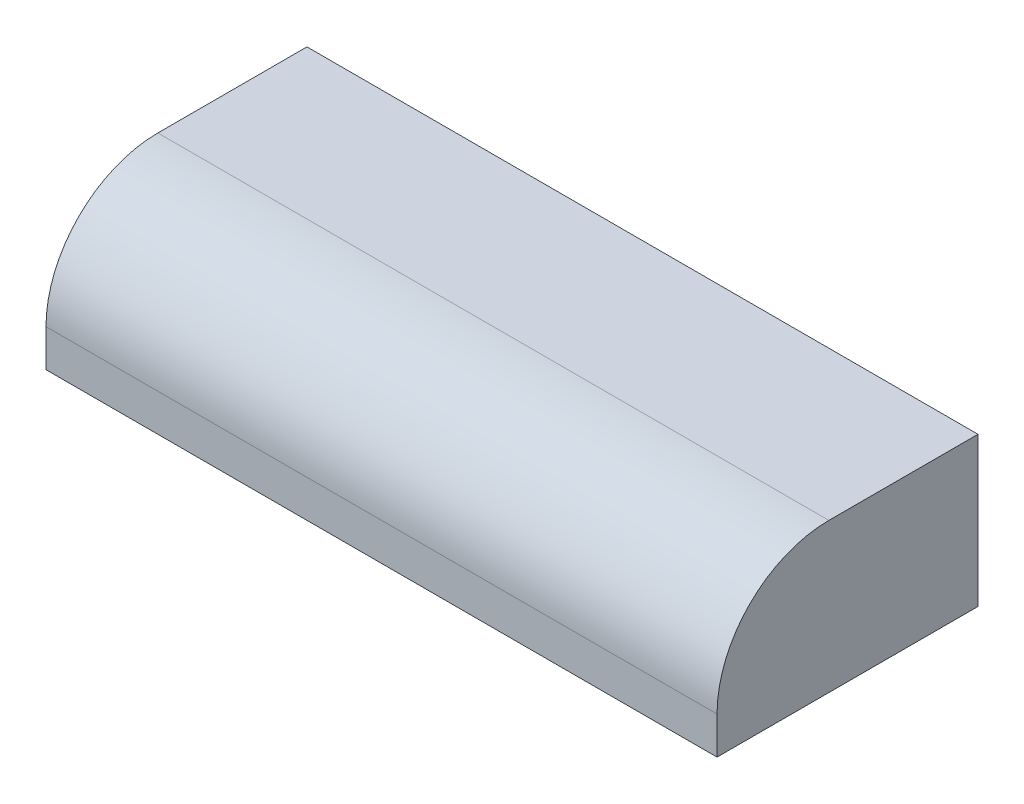
ISO-10303-21;
HEADER;
FILE_DESCRIPTION(('STEP AP214'),'2;1');
FILE_NAME('part.step','',(''),(''),'','','');
FILE_SCHEMA(('AUTOMOTIVE_DESIGN { 1 0 10303 214 1 1 1 1 }'));
ENDSEC;
DATA;
#1=APPLICATION_CONTEXT('core data for automotive mechanical design processes');
#2=APPLICATION_PROTOCOL_DEFINITION('international standard','automotive_design',2000,#1);
#3=PRODUCT_CONTEXT('',#1,'mechanical');
#4=PRODUCT('Part','Part','',(#3));
#5=PRODUCT_RELATED_PRODUCT_CATEGORY('part','',(#4));
#6=PRODUCT_DEFINITION_FORMATION('','',#4);
#7=PRODUCT_DEFINITION_CONTEXT('part definition',#1,'design');
#8=PRODUCT_DEFINITION('design','',#6,#7);
#9=PRODUCT_DEFINITION_SHAPE('','',#8);
#10=(LENGTH_UNIT() NAMED_UNIT(*) SI_UNIT(.MILLI.,.METRE.));
#11=(NAMED_UNIT(*) PLANE_ANGLE_UNIT() SI_UNIT($,.RADIAN.));
#12=(NAMED_UNIT(*) SI_UNIT($,.STERADIAN.) SOLID_ANGLE_UNIT());
#13=UNCERTAINTY_MEASURE_WITH_UNIT(LENGTH_MEASURE(1.E-05),#10,'distance_accuracy_value','');
#14=(GEOMETRIC_REPRESENTATION_CONTEXT(3) GLOBAL_UNCERTAINTY_ASSIGNED_CONTEXT((#13)) GLOBAL_UNIT_ASSIGNED_CONTEXT((#10,
#11,#12)) REPRESENTATION_CONTEXT('',''));
#15=CARTESIAN_POINT('',(0.,0.,0.));
#16=DIRECTION('',(0.,0.,1.));
#17=DIRECTION('',(1.,0.,0.));
#18=AXIS2_PLACEMENT_3D('',#15,#16,#17);
#19=CARTESIAN_POINT('',(914.4,0.,0.));
#20=DIRECTION('',(0.,0.,-1.));
#21=DIRECTION('',(-1.,0.,0.));
#22=AXIS2_PLACEMENT_3D('',#19,#20,#21);
#23=PLANE('',#22);
#24=DIRECTION('',(0.,-1.,0.));
#25=VECTOR('',#24,1.);
#26=CARTESIAN_POINT('',(914.4,0.,0.));
#27=LINE('',#26,#25);
#28=CARTESIAN_POINT('',(914.4,50.8,0.));
#29=VERTEX_POINT('',#28);
#30=CARTESIAN_POINT('',(914.4,0.,0.));
#31=VERTEX_POINT('',#30);
#32=EDGE_CURVE('E79',#29,#31,#27,.T.);
#33=ORIENTED_EDGE('',*,*,#32,.F.);
#34=DIRECTION('',(-1.,0.,0.));
#35=VECTOR('',#34,1.);
#36=CARTESIAN_POINT('',(914.4,50.8,0.));
#37=LINE('',#36,#35);
#38=CARTESIAN_POINT('',(0.,50.8,0.));
#39=VERTEX_POINT('',#38);
#40=EDGE_CURVE('E102',#29,#39,#37,.T.);
#41=ORIENTED_EDGE('',*,*,#40,.T.);
#42=DIRECTION('',(0.,-1.,0.));
#43=VECTOR('',#42,1.);
#44=CARTESIAN_POINT('',(0.,0.,0.));
#45=LINE('',#44,#43);
#46=CARTESIAN_POINT('',(0.,0.,0.));
#47=VERTEX_POINT('',#46);
#48=EDGE_CURVE('E100',#39,#47,#45,.T.);
#49=ORIENTED_EDGE('',*,*,#48,.T.);
#50=DIRECTION('',(-1.,0.,0.));
#51=VECTOR('',#50,1.);
#52=CARTESIAN_POINT('',(914.4,0.,0.));
#53=LINE('',#52,#51);
#54=EDGE_CURVE('E94',#31,#47,#53,.T.);
#55=ORIENTED_EDGE('',*,*,#54,.F.);
#56=EDGE_LOOP('',(#33,#41,#49,#55));
#57=FACE_BOUND('',#56,.T.);
#58=ADVANCED_FACE('F33',(#57),#23,.F.);
#59=CARTESIAN_POINT('',(914.4,0.,-355.6));
#60=DIRECTION('',(0.,1.,0.));
#61=DIRECTION('',(0.,0.,1.));
#62=AXIS2_PLACEMENT_3D('',#59,#60,#61);
#63=PLANE('',#62);
#64=DIRECTION('',(0.,0.,-1.));
#65=VECTOR('',#64,1.);
#66=CARTESIAN_POINT('',(0.,0.,-355.6));
#67=LINE('',#66,#65);
#68=CARTESIAN_POINT('',(0.,0.,-355.6));
#69=VERTEX_POINT('',#68);
#70=EDGE_CURVE('E115',#47,#69,#67,.T.);
#71=ORIENTED_EDGE('',*,*,#70,.T.);
#72=DIRECTION('',(-1.,0.,0.));
#73=VECTOR('',#72,1.);
#74=CARTESIAN_POINT('',(914.4,0.,-355.6));
#75=LINE('',#74,#73);
#76=CARTESIAN_POINT('',(914.4,0.,-355.6));
#77=VERTEX_POINT('',#76);
#78=EDGE_CURVE('E96',#77,#69,#75,.T.);
#79=ORIENTED_EDGE('',*,*,#78,.F.);
#80=DIRECTION('',(0.,0.,-1.));
#81=VECTOR('',#80,1.);
#82=CARTESIAN_POINT('',(914.4,0.,-355.6));
#83=LINE('',#82,#81);
#84=EDGE_CURVE('E82',#31,#77,#83,.T.);
#85=ORIENTED_EDGE('',*,*,#84,.F.);
#86=ORIENTED_EDGE('',*,*,#54,.T.);
#87=EDGE_LOOP('',(#71,#79,#85,#86));
#88=FACE_BOUND('',#87,.T.);
#89=ADVANCED_FACE('F93',(#88),#63,.F.);
#90=CARTESIAN_POINT('',(914.4,203.2,-355.6));
#91=DIRECTION('',(0.,0.,1.));
#92=DIRECTION('',(1.,0.,0.));
#93=AXIS2_PLACEMENT_3D('',#90,#91,#92);
#94=PLANE('',#93);
#95=DIRECTION('',(0.,1.,0.));
#96=VECTOR('',#95,1.);
#97=CARTESIAN_POINT('',(0.,203.2,-355.6));
#98=LINE('',#97,#96);
#99=CARTESIAN_POINT('',(0.,203.2,-355.6));
#100=VERTEX_POINT('',#99);
#101=EDGE_CURVE('E113',#69,#100,#98,.T.);
#102=ORIENTED_EDGE('',*,*,#101,.T.);
#103=DIRECTION('',(-1.,0.,0.));
#104=VECTOR('',#103,1.);
#105=CARTESIAN_POINT('',(914.4,203.2,-355.6));
#106=LINE('',#105,#104);
#107=CARTESIAN_POINT('',(914.4,203.2,-355.6));
#108=VERTEX_POINT('',#107);
#109=EDGE_CURVE('E105',#108,#100,#106,.T.);
#110=ORIENTED_EDGE('',*,*,#109,.F.);
#111=DIRECTION('',(0.,1.,0.));
#112=VECTOR('',#111,1.);
#113=CARTESIAN_POINT('',(914.4,203.2,-355.6));
#114=LINE('',#113,#112);
#115=EDGE_CURVE('E98',#77,#108,#114,.T.);
#116=ORIENTED_EDGE('',*,*,#115,.F.);
#117=ORIENTED_EDGE('',*,*,#78,.T.);
#118=EDGE_LOOP('',(#102,#110,#116,#117));
#119=FACE_BOUND('',#118,.T.);
#120=ADVANCED_FACE('F121',(#119),#94,.F.);
#121=CARTESIAN_POINT('',(914.4,203.2,0.));
#122=DIRECTION('',(0.,-1.,0.));
#123=DIRECTION('',(0.,0.,-1.));
#124=AXIS2_PLACEMENT_3D('',#121,#122,#123);
#125=PLANE('',#124);
#126=DIRECTION('',(0.,0.,1.));
#127=VECTOR('',#126,1.);
#128=CARTESIAN_POINT('',(0.,203.2,0.));
#129=LINE('',#128,#127);
#130=CARTESIAN_POINT('',(0.,203.2,-152.4));
#131=VERTEX_POINT('',#130);
#132=EDGE_CURVE('E89',#100,#131,#129,.T.);
#133=ORIENTED_EDGE('',*,*,#132,.T.);
#134=DIRECTION('',(-1.,0.,0.));
#135=VECTOR('',#134,1.);
#136=CARTESIAN_POINT('',(914.4,203.2,-152.4));
#137=LINE('',#136,#135);
#138=CARTESIAN_POINT('',(914.4,203.2,-152.4));
#139=VERTEX_POINT('',#138);
#140=EDGE_CURVE('E41',#131,#139,#137,.F.);
#141=ORIENTED_EDGE('',*,*,#140,.T.);
#142=DIRECTION('',(0.,0.,1.));
#143=VECTOR('',#142,1.);
#144=CARTESIAN_POINT('',(914.4,203.2,0.));
#145=LINE('',#144,#143);
#146=EDGE_CURVE('E111',#108,#139,#145,.T.);
#147=ORIENTED_EDGE('',*,*,#146,.F.);
#148=ORIENTED_EDGE('',*,*,#109,.T.);
#149=EDGE_LOOP('',(#133,#141,#147,#148));
#150=FACE_BOUND('',#149,.T.);
#151=ADVANCED_FACE('F123',(#150),#125,.F.);
#152=CARTESIAN_POINT('',(914.4,0.,0.));
#153=DIRECTION('',(-1.,0.,0.));
#154=DIRECTION('',(0.,0.,1.));
#155=AXIS2_PLACEMENT_3D('',#152,#153,#154);
#156=PLANE('',#155);
#157=ORIENTED_EDGE('',*,*,#146,.T.);
#158=CARTESIAN_POINT('',(914.4,50.8,-152.4));
#159=DIRECTION('',(-1.,0.,0.));
#160=DIRECTION('',(0.,0.,1.));
#161=AXIS2_PLACEMENT_3D('',#158,#159,#160);
#162=CIRCLE('',#161,152.4);
#163=EDGE_CURVE('E11',#139,#29,#162,.F.);
#164=ORIENTED_EDGE('',*,*,#163,.T.);
#165=ORIENTED_EDGE('',*,*,#32,.T.);
#166=ORIENTED_EDGE('',*,*,#84,.T.);
#167=ORIENTED_EDGE('',*,*,#115,.T.);
#168=EDGE_LOOP('',(#157,#164,#165,#166,#167));
#169=FACE_BOUND('',#168,.T.);
#170=ADVANCED_FACE('F81',(#169),#156,.F.);
#171=CARTESIAN_POINT('',(0.,0.,0.));
#172=DIRECTION('',(-1.,0.,0.));
#173=DIRECTION('',(0.,0.,1.));
#174=AXIS2_PLACEMENT_3D('',#171,#172,#173);
#175=PLANE('',#174);
#176=ORIENTED_EDGE('',*,*,#48,.F.);
#177=CARTESIAN_POINT('',(0.,50.8,-152.4));
#178=DIRECTION('',(-1.,0.,0.));
#179=DIRECTION('',(0.,0.,1.));
#180=AXIS2_PLACEMENT_3D('',#177,#178,#179);
#181=CIRCLE('',#180,152.4);
#182=EDGE_CURVE('E55',#39,#131,#181,.T.);
#183=ORIENTED_EDGE('',*,*,#182,.T.);
#184=ORIENTED_EDGE('',*,*,#132,.F.);
#185=ORIENTED_EDGE('',*,*,#101,.F.);
#186=ORIENTED_EDGE('',*,*,#70,.F.);
#187=EDGE_LOOP('',(#176,#183,#184,#185,#186));
#188=FACE_BOUND('',#187,.T.);
#189=ADVANCED_FACE('F130',(#188),#175,.T.);
#190=CARTESIAN_POINT('',(914.4,50.8,-152.4));
#191=DIRECTION('',(-1.,0.,0.));
#192=DIRECTION('',(0.,0.,1.));
#193=AXIS2_PLACEMENT_3D('',#190,#191,#192);
#194=CYLINDRICAL_SURFACE('',#193,152.4);
#195=ORIENTED_EDGE('',*,*,#163,.F.);
#196=ORIENTED_EDGE('',*,*,#140,.F.);
#197=ORIENTED_EDGE('',*,*,#182,.F.);
#198=ORIENTED_EDGE('',*,*,#40,.F.);
#199=EDGE_LOOP('',(#195,#196,#197,#198));
#200=FACE_BOUND('',#199,.T.);
#201=ADVANCED_FACE('F35',(#200),#194,.T.);
#202=CLOSED_SHELL('',(#58,#89,#120,#151,#170,#189,#201));
#203=MANIFOLD_SOLID_BREP('B2',#202);
#204=ADVANCED_BREP_SHAPE_REPRESENTATION('',(#18,#203),#14);
#205=SHAPE_DEFINITION_REPRESENTATION(#9,#204);
ENDSEC;
END-ISO-10303-21;
